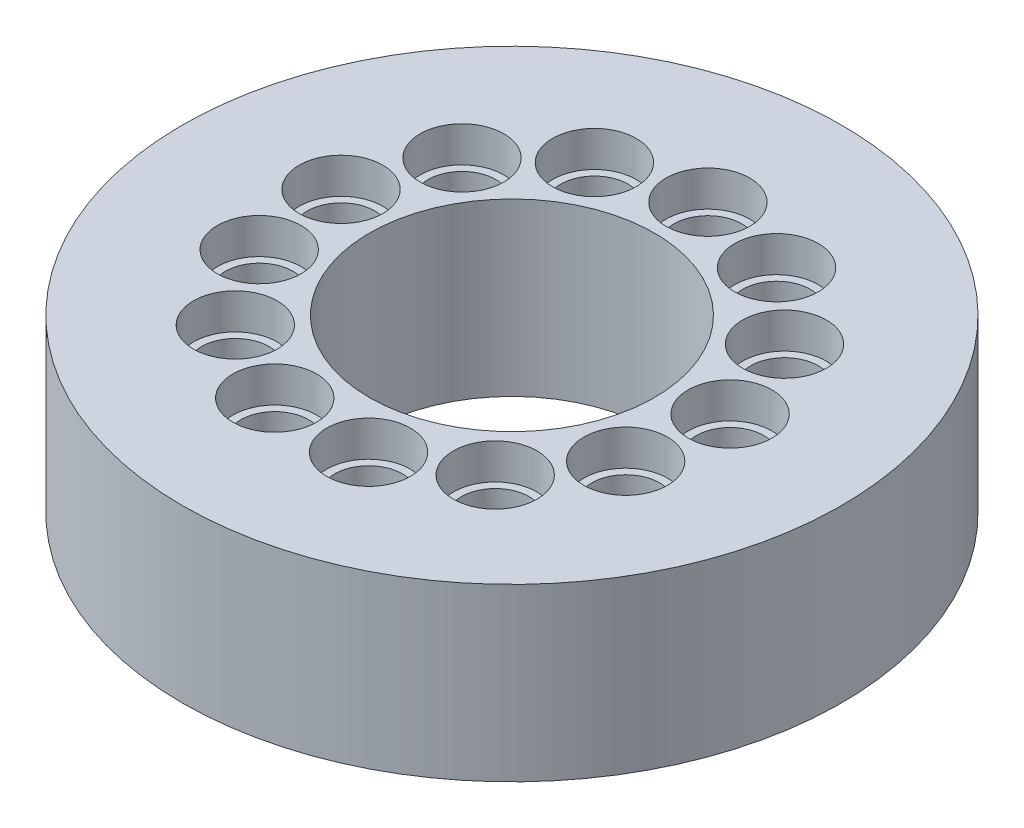
ISO-10303-21;
HEADER;
FILE_DESCRIPTION(('STEP AP214'),'2;1');
FILE_NAME('part.step','',(''),(''),'','','');
FILE_SCHEMA(('AUTOMOTIVE_DESIGN { 1 0 10303 214 1 1 1 1 }'));
ENDSEC;
DATA;
#1=APPLICATION_CONTEXT('core data for automotive mechanical design processes');
#2=APPLICATION_PROTOCOL_DEFINITION('international standard','automotive_design',2000,#1);
#3=PRODUCT_CONTEXT('',#1,'mechanical');
#4=PRODUCT('Part','Part','',(#3));
#5=PRODUCT_RELATED_PRODUCT_CATEGORY('part','',(#4));
#6=PRODUCT_DEFINITION_FORMATION('','',#4);
#7=PRODUCT_DEFINITION_CONTEXT('part definition',#1,'design');
#8=PRODUCT_DEFINITION('design','',#6,#7);
#9=PRODUCT_DEFINITION_SHAPE('','',#8);
#10=(LENGTH_UNIT() NAMED_UNIT(*) SI_UNIT(.MILLI.,.METRE.));
#11=(NAMED_UNIT(*) PLANE_ANGLE_UNIT() SI_UNIT($,.RADIAN.));
#12=(NAMED_UNIT(*) SI_UNIT($,.STERADIAN.) SOLID_ANGLE_UNIT());
#13=UNCERTAINTY_MEASURE_WITH_UNIT(LENGTH_MEASURE(1.E-05),#10,'distance_accuracy_value','');
#14=(GEOMETRIC_REPRESENTATION_CONTEXT(3) GLOBAL_UNCERTAINTY_ASSIGNED_CONTEXT((#13)) GLOBAL_UNIT_ASSIGNED_CONTEXT((#10,
#11,#12)) REPRESENTATION_CONTEXT('',''));
#15=CARTESIAN_POINT('',(0.,0.,0.));
#16=DIRECTION('',(0.,0.,1.));
#17=DIRECTION('',(1.,0.,0.));
#18=AXIS2_PLACEMENT_3D('',#15,#16,#17);
#19=CARTESIAN_POINT('',(0.,4.8,0.));
#20=DIRECTION('',(0.,1.,0.));
#21=DIRECTION('',(0.,0.,1.));
#22=AXIS2_PLACEMENT_3D('',#19,#20,#21);
#23=PLANE('',#22);
#24=CARTESIAN_POINT('',(-2.55597744624067,4.8,-4.87000814109269));
#25=DIRECTION('',(0.,1.,0.));
#26=DIRECTION('',(0.,0.,1.));
#27=AXIS2_PLACEMENT_3D('',#24,#25,#26);
#28=CIRCLE('',#27,1.17500000000001);
#29=CARTESIAN_POINT('',(-2.55597744624067,4.8,-3.69500814109267));
#30=VERTEX_POINT('',#29);
#31=EDGE_CURVE('E263',#30,#30,#28,.T.);
#32=ORIENTED_EDGE('',*,*,#31,.F.);
#33=EDGE_LOOP('',(#32));
#34=FACE_BOUND('',#33,.T.);
#35=CARTESIAN_POINT('',(-4.52641126241507,4.8,-3.12435610702141));
#36=DIRECTION('',(0.,1.,0.));
#37=DIRECTION('',(0.,0.,1.));
#38=AXIS2_PLACEMENT_3D('',#35,#36,#37);
#39=CIRCLE('',#38,1.17500000000001);
#40=CARTESIAN_POINT('',(-4.52641126241507,4.8,-1.9493561070214));
#41=VERTEX_POINT('',#40);
#42=EDGE_CURVE('E247',#41,#41,#39,.T.);
#43=ORIENTED_EDGE('',*,*,#42,.F.);
#44=EDGE_LOOP('',(#43));
#45=FACE_BOUND('',#44,.T.);
#46=CARTESIAN_POINT('',(-5.45989880753929,4.8,-0.662951741404336));
#47=DIRECTION('',(0.,1.,0.));
#48=DIRECTION('',(0.,0.,1.));
#49=AXIS2_PLACEMENT_3D('',#46,#47,#48);
#50=CIRCLE('',#49,1.17500000000001);
#51=CARTESIAN_POINT('',(-5.45989880753929,4.8,0.512048258595678));
#52=VERTEX_POINT('',#51);
#53=EDGE_CURVE('E231',#52,#52,#50,.T.);
#54=ORIENTED_EDGE('',*,*,#53,.F.);
#55=EDGE_LOOP('',(#54));
#56=FACE_BOUND('',#55,.T.);
#57=CARTESIAN_POINT('',(-5.1425893347698,4.8,1.9503268787339));
#58=DIRECTION('',(0.,1.,0.));
#59=DIRECTION('',(0.,0.,1.));
#60=AXIS2_PLACEMENT_3D('',#57,#58,#59);
#61=CIRCLE('',#60,1.17500000000001);
#62=CARTESIAN_POINT('',(-5.1425893347698,4.8,3.12532687873391));
#63=VERTEX_POINT('',#62);
#64=EDGE_CURVE('E215',#63,#63,#61,.T.);
#65=ORIENTED_EDGE('',*,*,#64,.F.);
#66=EDGE_LOOP('',(#65));
#67=FACE_BOUND('',#66,.T.);
#68=CARTESIAN_POINT('',(-3.64717462032441,4.8,4.11680911494102));
#69=DIRECTION('',(0.,1.,0.));
#70=DIRECTION('',(0.,0.,1.));
#71=AXIS2_PLACEMENT_3D('',#68,#69,#70);
#72=CIRCLE('',#71,1.17500000000001);
#73=CARTESIAN_POINT('',(-3.64717462032441,4.8,5.29180911494104));
#74=VERTEX_POINT('',#73);
#75=EDGE_CURVE('E199',#74,#74,#72,.T.);
#76=ORIENTED_EDGE('',*,*,#75,.F.);
#77=EDGE_LOOP('',(#76));
#78=FACE_BOUND('',#77,.T.);
#79=CARTESIAN_POINT('',(-1.31623615358161,4.8,5.34017999584328));
#80=DIRECTION('',(0.,1.,0.));
#81=DIRECTION('',(0.,0.,1.));
#82=AXIS2_PLACEMENT_3D('',#79,#80,#81);
#83=CIRCLE('',#82,1.17500000000001);
#84=CARTESIAN_POINT('',(-1.31623615358161,4.8,6.51517999584329));
#85=VERTEX_POINT('',#84);
#86=EDGE_CURVE('E183',#85,#85,#83,.T.);
#87=ORIENTED_EDGE('',*,*,#86,.F.);
#88=EDGE_LOOP('',(#87));
#89=FACE_BOUND('',#88,.T.);
#90=CARTESIAN_POINT('',(1.31623615358153,4.8,5.34017999584329));
#91=DIRECTION('',(0.,1.,0.));
#92=DIRECTION('',(0.,0.,1.));
#93=AXIS2_PLACEMENT_3D('',#90,#91,#92);
#94=CIRCLE('',#93,1.17500000000001);
#95=CARTESIAN_POINT('',(1.31623615358153,4.8,6.51517999584331));
#96=VERTEX_POINT('',#95);
#97=EDGE_CURVE('E167',#96,#96,#94,.T.);
#98=ORIENTED_EDGE('',*,*,#97,.F.);
#99=EDGE_LOOP('',(#98));
#100=FACE_BOUND('',#99,.T.);
#101=CARTESIAN_POINT('',(3.64717462032435,4.8,4.11680911494108));
#102=DIRECTION('',(0.,1.,0.));
#103=DIRECTION('',(0.,0.,1.));
#104=AXIS2_PLACEMENT_3D('',#101,#102,#103);
#105=CIRCLE('',#104,1.17500000000001);
#106=CARTESIAN_POINT('',(3.64717462032435,4.8,5.29180911494109));
#107=VERTEX_POINT('',#106);
#108=EDGE_CURVE('E151',#107,#107,#105,.T.);
#109=ORIENTED_EDGE('',*,*,#108,.F.);
#110=EDGE_LOOP('',(#109));
#111=FACE_BOUND('',#110,.T.);
#112=CARTESIAN_POINT('',(5.14258933476977,4.8,1.95032687873397));
#113=DIRECTION('',(0.,1.,0.));
#114=DIRECTION('',(0.,0.,1.));
#115=AXIS2_PLACEMENT_3D('',#112,#113,#114);
#116=CIRCLE('',#115,1.17500000000001);
#117=CARTESIAN_POINT('',(5.14258933476977,4.8,3.12532687873398));
#118=VERTEX_POINT('',#117);
#119=EDGE_CURVE('E135',#118,#118,#116,.T.);
#120=ORIENTED_EDGE('',*,*,#119,.F.);
#121=EDGE_LOOP('',(#120));
#122=FACE_BOUND('',#121,.T.);
#123=CARTESIAN_POINT('',(5.4598988075393,4.8,-0.662951741404259));
#124=DIRECTION('',(0.,1.,0.));
#125=DIRECTION('',(0.,0.,1.));
#126=AXIS2_PLACEMENT_3D('',#123,#124,#125);
#127=CIRCLE('',#126,1.17500000000001);
#128=CARTESIAN_POINT('',(5.4598988075393,4.8,0.512048258595754));
#129=VERTEX_POINT('',#128);
#130=EDGE_CURVE('E119',#129,#129,#127,.T.);
#131=ORIENTED_EDGE('',*,*,#130,.F.);
#132=EDGE_LOOP('',(#131));
#133=FACE_BOUND('',#132,.T.);
#134=CARTESIAN_POINT('',(4.52641126241512,4.8,-3.12435610702135));
#135=DIRECTION('',(0.,1.,0.));
#136=DIRECTION('',(0.,0.,1.));
#137=AXIS2_PLACEMENT_3D('',#134,#135,#136);
#138=CIRCLE('',#137,1.17500000000001);
#139=CARTESIAN_POINT('',(4.52641126241512,4.8,-1.94935610702133));
#140=VERTEX_POINT('',#139);
#141=EDGE_CURVE('E103',#140,#140,#138,.T.);
#142=ORIENTED_EDGE('',*,*,#141,.F.);
#143=EDGE_LOOP('',(#142));
#144=FACE_BOUND('',#143,.T.);
#145=CARTESIAN_POINT('',(2.55597744624073,4.8,-4.87000814109265));
#146=DIRECTION('',(0.,1.,0.));
#147=DIRECTION('',(0.,0.,1.));
#148=AXIS2_PLACEMENT_3D('',#145,#146,#147);
#149=CIRCLE('',#148,1.17500000000001);
#150=CARTESIAN_POINT('',(2.55597744624073,4.8,-3.69500814109264));
#151=VERTEX_POINT('',#150);
#152=EDGE_CURVE('E87',#151,#151,#149,.T.);
#153=ORIENTED_EDGE('',*,*,#152,.F.);
#154=EDGE_LOOP('',(#153));
#155=FACE_BOUND('',#154,.T.);
#156=CARTESIAN_POINT('',(0.,4.8,-5.5));
#157=DIRECTION('',(0.,1.,0.));
#158=DIRECTION('',(0.,0.,1.));
#159=AXIS2_PLACEMENT_3D('',#156,#157,#158);
#160=CIRCLE('',#159,1.17500000000001);
#161=CARTESIAN_POINT('',(0.,4.8,-4.32499999999999));
#162=VERTEX_POINT('',#161);
#163=EDGE_CURVE('E71',#162,#162,#160,.T.);
#164=ORIENTED_EDGE('',*,*,#163,.F.);
#165=EDGE_LOOP('',(#164));
#166=FACE_BOUND('',#165,.T.);
#167=CARTESIAN_POINT('',(0.,4.8,0.));
#168=DIRECTION('',(0.,1.,0.));
#169=DIRECTION('',(0.,0.,1.));
#170=AXIS2_PLACEMENT_3D('',#167,#168,#169);
#171=CIRCLE('',#170,9.25);
#172=CARTESIAN_POINT('',(0.,4.8,9.25));
#173=VERTEX_POINT('',#172);
#174=EDGE_CURVE('E10',#173,#173,#171,.T.);
#175=ORIENTED_EDGE('',*,*,#174,.T.);
#176=EDGE_LOOP('',(#175));
#177=FACE_BOUND('',#176,.T.);
#178=CARTESIAN_POINT('',(0.,4.8,0.));
#179=DIRECTION('',(0.,1.,0.));
#180=DIRECTION('',(0.,0.,1.));
#181=AXIS2_PLACEMENT_3D('',#178,#179,#180);
#182=CIRCLE('',#181,4.);
#183=CARTESIAN_POINT('',(0.,4.8,4.));
#184=VERTEX_POINT('',#183);
#185=EDGE_CURVE('E50',#184,#184,#182,.T.);
#186=ORIENTED_EDGE('',*,*,#185,.F.);
#187=EDGE_LOOP('',(#186));
#188=FACE_BOUND('',#187,.T.);
#189=ADVANCED_FACE('F37',(#34,#45,#56,#67,#78,#89,#100,#111,#122,#133,#144,#155,#166,#177,#188),
#23,.T.);
#190=CARTESIAN_POINT('',(0.,0.,0.));
#191=DIRECTION('',(0.,1.,0.));
#192=DIRECTION('',(0.,0.,1.));
#193=AXIS2_PLACEMENT_3D('',#190,#191,#192);
#194=PLANE('',#193);
#195=CARTESIAN_POINT('',(-2.55597744624067,0.,-4.87000814109269));
#196=DIRECTION('',(0.,1.,0.));
#197=DIRECTION('',(0.,0.,1.));
#198=AXIS2_PLACEMENT_3D('',#195,#196,#197);
#199=CIRCLE('',#198,0.950000000000013);
#200=CARTESIAN_POINT('',(-2.55597744624067,0.,-3.92000814109267));
#201=VERTEX_POINT('',#200);
#202=EDGE_CURVE('E251',#201,#201,#199,.T.);
#203=ORIENTED_EDGE('',*,*,#202,.T.);
#204=EDGE_LOOP('',(#203));
#205=FACE_BOUND('',#204,.T.);
#206=CARTESIAN_POINT('',(-4.52641126241507,0.,-3.12435610702141));
#207=DIRECTION('',(0.,1.,0.));
#208=DIRECTION('',(0.,0.,1.));
#209=AXIS2_PLACEMENT_3D('',#206,#207,#208);
#210=CIRCLE('',#209,0.950000000000013);
#211=CARTESIAN_POINT('',(-4.52641126241507,0.,-2.1743561070214));
#212=VERTEX_POINT('',#211);
#213=EDGE_CURVE('E235',#212,#212,#210,.T.);
#214=ORIENTED_EDGE('',*,*,#213,.T.);
#215=EDGE_LOOP('',(#214));
#216=FACE_BOUND('',#215,.T.);
#217=CARTESIAN_POINT('',(-5.45989880753929,0.,-0.662951741404336));
#218=DIRECTION('',(0.,1.,0.));
#219=DIRECTION('',(0.,0.,1.));
#220=AXIS2_PLACEMENT_3D('',#217,#218,#219);
#221=CIRCLE('',#220,0.950000000000013);
#222=CARTESIAN_POINT('',(-5.45989880753929,0.,0.287048258595677));
#223=VERTEX_POINT('',#222);
#224=EDGE_CURVE('E219',#223,#223,#221,.T.);
#225=ORIENTED_EDGE('',*,*,#224,.T.);
#226=EDGE_LOOP('',(#225));
#227=FACE_BOUND('',#226,.T.);
#228=CARTESIAN_POINT('',(-5.1425893347698,0.,1.9503268787339));
#229=DIRECTION('',(0.,1.,0.));
#230=DIRECTION('',(0.,0.,1.));
#231=AXIS2_PLACEMENT_3D('',#228,#229,#230);
#232=CIRCLE('',#231,0.950000000000013);
#233=CARTESIAN_POINT('',(-5.1425893347698,0.,2.90032687873391));
#234=VERTEX_POINT('',#233);
#235=EDGE_CURVE('E203',#234,#234,#232,.T.);
#236=ORIENTED_EDGE('',*,*,#235,.T.);
#237=EDGE_LOOP('',(#236));
#238=FACE_BOUND('',#237,.T.);
#239=CARTESIAN_POINT('',(-3.64717462032441,0.,4.11680911494102));
#240=DIRECTION('',(0.,1.,0.));
#241=DIRECTION('',(0.,0.,1.));
#242=AXIS2_PLACEMENT_3D('',#239,#240,#241);
#243=CIRCLE('',#242,0.950000000000013);
#244=CARTESIAN_POINT('',(-3.64717462032441,0.,5.06680911494104));
#245=VERTEX_POINT('',#244);
#246=EDGE_CURVE('E187',#245,#245,#243,.T.);
#247=ORIENTED_EDGE('',*,*,#246,.T.);
#248=EDGE_LOOP('',(#247));
#249=FACE_BOUND('',#248,.T.);
#250=CARTESIAN_POINT('',(-1.31623615358161,0.,5.34017999584328));
#251=DIRECTION('',(0.,1.,0.));
#252=DIRECTION('',(0.,0.,1.));
#253=AXIS2_PLACEMENT_3D('',#250,#251,#252);
#254=CIRCLE('',#253,0.950000000000013);
#255=CARTESIAN_POINT('',(-1.31623615358161,0.,6.29017999584329));
#256=VERTEX_POINT('',#255);
#257=EDGE_CURVE('E171',#256,#256,#254,.T.);
#258=ORIENTED_EDGE('',*,*,#257,.T.);
#259=EDGE_LOOP('',(#258));
#260=FACE_BOUND('',#259,.T.);
#261=CARTESIAN_POINT('',(1.31623615358153,0.,5.34017999584329));
#262=DIRECTION('',(0.,1.,0.));
#263=DIRECTION('',(0.,0.,1.));
#264=AXIS2_PLACEMENT_3D('',#261,#262,#263);
#265=CIRCLE('',#264,0.950000000000013);
#266=CARTESIAN_POINT('',(1.31623615358153,0.,6.29017999584331));
#267=VERTEX_POINT('',#266);
#268=EDGE_CURVE('E155',#267,#267,#265,.T.);
#269=ORIENTED_EDGE('',*,*,#268,.T.);
#270=EDGE_LOOP('',(#269));
#271=FACE_BOUND('',#270,.T.);
#272=CARTESIAN_POINT('',(3.64717462032435,0.,4.11680911494108));
#273=DIRECTION('',(0.,1.,0.));
#274=DIRECTION('',(0.,0.,1.));
#275=AXIS2_PLACEMENT_3D('',#272,#273,#274);
#276=CIRCLE('',#275,0.950000000000013);
#277=CARTESIAN_POINT('',(3.64717462032435,0.,5.06680911494109));
#278=VERTEX_POINT('',#277);
#279=EDGE_CURVE('E139',#278,#278,#276,.T.);
#280=ORIENTED_EDGE('',*,*,#279,.T.);
#281=EDGE_LOOP('',(#280));
#282=FACE_BOUND('',#281,.T.);
#283=CARTESIAN_POINT('',(5.14258933476977,0.,1.95032687873397));
#284=DIRECTION('',(0.,1.,0.));
#285=DIRECTION('',(0.,0.,1.));
#286=AXIS2_PLACEMENT_3D('',#283,#284,#285);
#287=CIRCLE('',#286,0.950000000000013);
#288=CARTESIAN_POINT('',(5.14258933476977,0.,2.90032687873398));
#289=VERTEX_POINT('',#288);
#290=EDGE_CURVE('E123',#289,#289,#287,.T.);
#291=ORIENTED_EDGE('',*,*,#290,.T.);
#292=EDGE_LOOP('',(#291));
#293=FACE_BOUND('',#292,.T.);
#294=CARTESIAN_POINT('',(5.4598988075393,0.,-0.662951741404259));
#295=DIRECTION('',(0.,1.,0.));
#296=DIRECTION('',(0.,0.,1.));
#297=AXIS2_PLACEMENT_3D('',#294,#295,#296);
#298=CIRCLE('',#297,0.950000000000013);
#299=CARTESIAN_POINT('',(5.4598988075393,0.,0.287048258595754));
#300=VERTEX_POINT('',#299);
#301=EDGE_CURVE('E107',#300,#300,#298,.T.);
#302=ORIENTED_EDGE('',*,*,#301,.T.);
#303=EDGE_LOOP('',(#302));
#304=FACE_BOUND('',#303,.T.);
#305=CARTESIAN_POINT('',(4.52641126241512,0.,-3.12435610702135));
#306=DIRECTION('',(0.,1.,0.));
#307=DIRECTION('',(0.,0.,1.));
#308=AXIS2_PLACEMENT_3D('',#305,#306,#307);
#309=CIRCLE('',#308,0.950000000000013);
#310=CARTESIAN_POINT('',(4.52641126241512,0.,-2.17435610702133));
#311=VERTEX_POINT('',#310);
#312=EDGE_CURVE('E91',#311,#311,#309,.T.);
#313=ORIENTED_EDGE('',*,*,#312,.T.);
#314=EDGE_LOOP('',(#313));
#315=FACE_BOUND('',#314,.T.);
#316=CARTESIAN_POINT('',(2.55597744624073,0.,-4.87000814109265));
#317=DIRECTION('',(0.,1.,0.));
#318=DIRECTION('',(0.,0.,1.));
#319=AXIS2_PLACEMENT_3D('',#316,#317,#318);
#320=CIRCLE('',#319,0.950000000000013);
#321=CARTESIAN_POINT('',(2.55597744624073,0.,-3.92000814109264));
#322=VERTEX_POINT('',#321);
#323=EDGE_CURVE('E75',#322,#322,#320,.T.);
#324=ORIENTED_EDGE('',*,*,#323,.T.);
#325=EDGE_LOOP('',(#324));
#326=FACE_BOUND('',#325,.T.);
#327=CARTESIAN_POINT('',(0.,0.,-5.5));
#328=DIRECTION('',(0.,1.,0.));
#329=DIRECTION('',(0.,0.,1.));
#330=AXIS2_PLACEMENT_3D('',#327,#328,#329);
#331=CIRCLE('',#330,0.950000000000013);
#332=CARTESIAN_POINT('',(0.,0.,-4.54999999999999));
#333=VERTEX_POINT('',#332);
#334=EDGE_CURVE('E56',#333,#333,#331,.T.);
#335=ORIENTED_EDGE('',*,*,#334,.T.);
#336=EDGE_LOOP('',(#335));
#337=FACE_BOUND('',#336,.T.);
#338=CARTESIAN_POINT('',(0.,0.,0.));
#339=DIRECTION('',(0.,1.,0.));
#340=DIRECTION('',(0.,0.,1.));
#341=AXIS2_PLACEMENT_3D('',#338,#339,#340);
#342=CIRCLE('',#341,9.25);
#343=CARTESIAN_POINT('',(0.,0.,9.25));
#344=VERTEX_POINT('',#343);
#345=EDGE_CURVE('E41',#344,#344,#342,.T.);
#346=ORIENTED_EDGE('',*,*,#345,.F.);
#347=EDGE_LOOP('',(#346));
#348=FACE_BOUND('',#347,.T.);
#349=CARTESIAN_POINT('',(0.,0.,0.));
#350=DIRECTION('',(0.,1.,0.));
#351=DIRECTION('',(0.,0.,1.));
#352=AXIS2_PLACEMENT_3D('',#349,#350,#351);
#353=CIRCLE('',#352,4.);
#354=CARTESIAN_POINT('',(0.,0.,4.));
#355=VERTEX_POINT('',#354);
#356=EDGE_CURVE('E52',#355,#355,#353,.T.);
#357=ORIENTED_EDGE('',*,*,#356,.T.);
#358=EDGE_LOOP('',(#357));
#359=FACE_BOUND('',#358,.T.);
#360=ADVANCED_FACE('F272',(#205,#216,#227,#238,#249,#260,#271,#282,#293,#304,#315,#326,#337,
#348,#359),#194,.F.);
#361=CARTESIAN_POINT('',(0.,4.8,0.));
#362=DIRECTION('',(0.,-1.,0.));
#363=DIRECTION('',(0.,0.,-1.));
#364=AXIS2_PLACEMENT_3D('',#361,#362,#363);
#365=CYLINDRICAL_SURFACE('',#364,9.25);
#366=ORIENTED_EDGE('',*,*,#174,.F.);
#367=EDGE_LOOP('',(#366));
#368=FACE_BOUND('',#367,.T.);
#369=ORIENTED_EDGE('',*,*,#345,.T.);
#370=EDGE_LOOP('',(#369));
#371=FACE_BOUND('',#370,.T.);
#372=ADVANCED_FACE('F39',(#368,#371),#365,.T.);
#373=CARTESIAN_POINT('',(0.,4.8,0.));
#374=DIRECTION('',(0.,-1.,0.));
#375=DIRECTION('',(0.,0.,-1.));
#376=AXIS2_PLACEMENT_3D('',#373,#374,#375);
#377=CYLINDRICAL_SURFACE('',#376,4.);
#378=ORIENTED_EDGE('',*,*,#185,.T.);
#379=EDGE_LOOP('',(#378));
#380=FACE_BOUND('',#379,.T.);
#381=ORIENTED_EDGE('',*,*,#356,.F.);
#382=EDGE_LOOP('',(#381));
#383=FACE_BOUND('',#382,.T.);
#384=ADVANCED_FACE('F300',(#380,#383),#377,.F.);
#385=CARTESIAN_POINT('',(0.,4.8,-5.5));
#386=DIRECTION('',(0.,1.,0.));
#387=DIRECTION('',(0.,0.,1.));
#388=AXIS2_PLACEMENT_3D('',#385,#386,#387);
#389=CYLINDRICAL_SURFACE('',#388,0.950000000000013);
#390=ORIENTED_EDGE('',*,*,#334,.F.);
#391=EDGE_LOOP('',(#390));
#392=FACE_BOUND('',#391,.T.);
#393=CARTESIAN_POINT('',(0.,3.8,-5.5));
#394=DIRECTION('',(0.,1.,0.));
#395=DIRECTION('',(0.,0.,1.));
#396=AXIS2_PLACEMENT_3D('',#393,#394,#395);
#397=CIRCLE('',#396,0.950000000000013);
#398=CARTESIAN_POINT('',(0.,3.8,-4.54999999999999));
#399=VERTEX_POINT('',#398);
#400=EDGE_CURVE('E63',#399,#399,#397,.T.);
#401=ORIENTED_EDGE('',*,*,#400,.T.);
#402=EDGE_LOOP('',(#401));
#403=FACE_BOUND('',#402,.T.);
#404=ADVANCED_FACE('F303',(#392,#403),#389,.F.);
#405=CARTESIAN_POINT('',(0.950000000000013,3.8,-5.5));
#406=DIRECTION('',(0.,-1.,0.));
#407=DIRECTION('',(0.,0.,-1.));
#408=AXIS2_PLACEMENT_3D('',#405,#406,#407);
#409=PLANE('',#408);
#410=ORIENTED_EDGE('',*,*,#400,.F.);
#411=EDGE_LOOP('',(#410));
#412=FACE_BOUND('',#411,.T.);
#413=CARTESIAN_POINT('',(0.,3.8,-5.5));
#414=DIRECTION('',(0.,1.,0.));
#415=DIRECTION('',(0.,0.,1.));
#416=AXIS2_PLACEMENT_3D('',#413,#414,#415);
#417=CIRCLE('',#416,1.17500000000001);
#418=CARTESIAN_POINT('',(0.,3.8,-4.32499999999999));
#419=VERTEX_POINT('',#418);
#420=EDGE_CURVE('E67',#419,#419,#417,.T.);
#421=ORIENTED_EDGE('',*,*,#420,.T.);
#422=EDGE_LOOP('',(#421));
#423=FACE_BOUND('',#422,.T.);
#424=ADVANCED_FACE('F317',(#412,#423),#409,.F.);
#425=CARTESIAN_POINT('',(0.,4.8,-5.5));
#426=DIRECTION('',(0.,1.,0.));
#427=DIRECTION('',(0.,0.,1.));
#428=AXIS2_PLACEMENT_3D('',#425,#426,#427);
#429=CYLINDRICAL_SURFACE('',#428,1.17500000000001);
#430=ORIENTED_EDGE('',*,*,#420,.F.);
#431=EDGE_LOOP('',(#430));
#432=FACE_BOUND('',#431,.T.);
#433=ORIENTED_EDGE('',*,*,#163,.T.);
#434=EDGE_LOOP('',(#433));
#435=FACE_BOUND('',#434,.T.);
#436=ADVANCED_FACE('F321',(#432,#435),#429,.F.);
#437=CARTESIAN_POINT('',(2.55597744624073,4.8,-4.87000814109265));
#438=DIRECTION('',(0.,1.,0.));
#439=DIRECTION('',(0.,0.,1.));
#440=AXIS2_PLACEMENT_3D('',#437,#438,#439);
#441=CYLINDRICAL_SURFACE('',#440,0.950000000000013);
#442=ORIENTED_EDGE('',*,*,#323,.F.);
#443=EDGE_LOOP('',(#442));
#444=FACE_BOUND('',#443,.T.);
#445=CARTESIAN_POINT('',(2.55597744624073,3.8,-4.87000814109265));
#446=DIRECTION('',(0.,1.,0.));
#447=DIRECTION('',(0.,0.,1.));
#448=AXIS2_PLACEMENT_3D('',#445,#446,#447);
#449=CIRCLE('',#448,0.950000000000013);
#450=CARTESIAN_POINT('',(2.55597744624073,3.8,-3.92000814109264));
#451=VERTEX_POINT('',#450);
#452=EDGE_CURVE('E79',#451,#451,#449,.T.);
#453=ORIENTED_EDGE('',*,*,#452,.T.);
#454=EDGE_LOOP('',(#453));
#455=FACE_BOUND('',#454,.T.);
#456=ADVANCED_FACE('F325',(#444,#455),#441,.F.);
#457=CARTESIAN_POINT('',(3.50597744624075,3.8,-4.87000814109265));
#458=DIRECTION('',(0.,-1.,0.));
#459=DIRECTION('',(0.,0.,-1.));
#460=AXIS2_PLACEMENT_3D('',#457,#458,#459);
#461=PLANE('',#460);
#462=ORIENTED_EDGE('',*,*,#452,.F.);
#463=EDGE_LOOP('',(#462));
#464=FACE_BOUND('',#463,.T.);
#465=CARTESIAN_POINT('',(2.55597744624073,3.8,-4.87000814109265));
#466=DIRECTION('',(0.,1.,0.));
#467=DIRECTION('',(0.,0.,1.));
#468=AXIS2_PLACEMENT_3D('',#465,#466,#467);
#469=CIRCLE('',#468,1.17500000000001);
#470=CARTESIAN_POINT('',(2.55597744624073,3.8,-3.69500814109264));
#471=VERTEX_POINT('',#470);
#472=EDGE_CURVE('E83',#471,#471,#469,.T.);
#473=ORIENTED_EDGE('',*,*,#472,.T.);
#474=EDGE_LOOP('',(#473));
#475=FACE_BOUND('',#474,.T.);
#476=ADVANCED_FACE('F329',(#464,#475),#461,.F.);
#477=CARTESIAN_POINT('',(2.55597744624073,4.8,-4.87000814109265));
#478=DIRECTION('',(0.,1.,0.));
#479=DIRECTION('',(0.,0.,1.));
#480=AXIS2_PLACEMENT_3D('',#477,#478,#479);
#481=CYLINDRICAL_SURFACE('',#480,1.17500000000001);
#482=ORIENTED_EDGE('',*,*,#472,.F.);
#483=EDGE_LOOP('',(#482));
#484=FACE_BOUND('',#483,.T.);
#485=ORIENTED_EDGE('',*,*,#152,.T.);
#486=EDGE_LOOP('',(#485));
#487=FACE_BOUND('',#486,.T.);
#488=ADVANCED_FACE('F333',(#484,#487),#481,.F.);
#489=CARTESIAN_POINT('',(4.52641126241512,4.8,-3.12435610702135));
#490=DIRECTION('',(0.,1.,0.));
#491=DIRECTION('',(0.,0.,1.));
#492=AXIS2_PLACEMENT_3D('',#489,#490,#491);
#493=CYLINDRICAL_SURFACE('',#492,0.950000000000013);
#494=ORIENTED_EDGE('',*,*,#312,.F.);
#495=EDGE_LOOP('',(#494));
#496=FACE_BOUND('',#495,.T.);
#497=CARTESIAN_POINT('',(4.52641126241512,3.8,-3.12435610702135));
#498=DIRECTION('',(0.,1.,0.));
#499=DIRECTION('',(0.,0.,1.));
#500=AXIS2_PLACEMENT_3D('',#497,#498,#499);
#501=CIRCLE('',#500,0.950000000000013);
#502=CARTESIAN_POINT('',(4.52641126241512,3.8,-2.17435610702133));
#503=VERTEX_POINT('',#502);
#504=EDGE_CURVE('E95',#503,#503,#501,.T.);
#505=ORIENTED_EDGE('',*,*,#504,.T.);
#506=EDGE_LOOP('',(#505));
#507=FACE_BOUND('',#506,.T.);
#508=ADVANCED_FACE('F337',(#496,#507),#493,.F.);
#509=CARTESIAN_POINT('',(5.47641126241513,3.8,-3.12435610702135));
#510=DIRECTION('',(0.,-1.,0.));
#511=DIRECTION('',(0.,0.,-1.));
#512=AXIS2_PLACEMENT_3D('',#509,#510,#511);
#513=PLANE('',#512);
#514=ORIENTED_EDGE('',*,*,#504,.F.);
#515=EDGE_LOOP('',(#514));
#516=FACE_BOUND('',#515,.T.);
#517=CARTESIAN_POINT('',(4.52641126241512,3.8,-3.12435610702135));
#518=DIRECTION('',(0.,1.,0.));
#519=DIRECTION('',(0.,0.,1.));
#520=AXIS2_PLACEMENT_3D('',#517,#518,#519);
#521=CIRCLE('',#520,1.17500000000001);
#522=CARTESIAN_POINT('',(4.52641126241512,3.8,-1.94935610702133));
#523=VERTEX_POINT('',#522);
#524=EDGE_CURVE('E99',#523,#523,#521,.T.);
#525=ORIENTED_EDGE('',*,*,#524,.T.);
#526=EDGE_LOOP('',(#525));
#527=FACE_BOUND('',#526,.T.);
#528=ADVANCED_FACE('F341',(#516,#527),#513,.F.);
#529=CARTESIAN_POINT('',(4.52641126241512,4.8,-3.12435610702135));
#530=DIRECTION('',(0.,1.,0.));
#531=DIRECTION('',(0.,0.,1.));
#532=AXIS2_PLACEMENT_3D('',#529,#530,#531);
#533=CYLINDRICAL_SURFACE('',#532,1.17500000000001);
#534=ORIENTED_EDGE('',*,*,#524,.F.);
#535=EDGE_LOOP('',(#534));
#536=FACE_BOUND('',#535,.T.);
#537=ORIENTED_EDGE('',*,*,#141,.T.);
#538=EDGE_LOOP('',(#537));
#539=FACE_BOUND('',#538,.T.);
#540=ADVANCED_FACE('F345',(#536,#539),#533,.F.);
#541=CARTESIAN_POINT('',(5.4598988075393,4.8,-0.662951741404259));
#542=DIRECTION('',(0.,1.,0.));
#543=DIRECTION('',(0.,0.,1.));
#544=AXIS2_PLACEMENT_3D('',#541,#542,#543);
#545=CYLINDRICAL_SURFACE('',#544,0.950000000000013);
#546=ORIENTED_EDGE('',*,*,#301,.F.);
#547=EDGE_LOOP('',(#546));
#548=FACE_BOUND('',#547,.T.);
#549=CARTESIAN_POINT('',(5.4598988075393,3.8,-0.662951741404259));
#550=DIRECTION('',(0.,1.,0.));
#551=DIRECTION('',(0.,0.,1.));
#552=AXIS2_PLACEMENT_3D('',#549,#550,#551);
#553=CIRCLE('',#552,0.950000000000013);
#554=CARTESIAN_POINT('',(5.4598988075393,3.8,0.287048258595754));
#555=VERTEX_POINT('',#554);
#556=EDGE_CURVE('E111',#555,#555,#553,.T.);
#557=ORIENTED_EDGE('',*,*,#556,.T.);
#558=EDGE_LOOP('',(#557));
#559=FACE_BOUND('',#558,.T.);
#560=ADVANCED_FACE('F349',(#548,#559),#545,.F.);
#561=CARTESIAN_POINT('',(6.40989880753931,3.8,-0.662951741404259));
#562=DIRECTION('',(0.,-1.,0.));
#563=DIRECTION('',(0.,0.,-1.));
#564=AXIS2_PLACEMENT_3D('',#561,#562,#563);
#565=PLANE('',#564);
#566=ORIENTED_EDGE('',*,*,#556,.F.);
#567=EDGE_LOOP('',(#566));
#568=FACE_BOUND('',#567,.T.);
#569=CARTESIAN_POINT('',(5.4598988075393,3.8,-0.662951741404259));
#570=DIRECTION('',(0.,1.,0.));
#571=DIRECTION('',(0.,0.,1.));
#572=AXIS2_PLACEMENT_3D('',#569,#570,#571);
#573=CIRCLE('',#572,1.17500000000001);
#574=CARTESIAN_POINT('',(5.4598988075393,3.8,0.512048258595753));
#575=VERTEX_POINT('',#574);
#576=EDGE_CURVE('E115',#575,#575,#573,.T.);
#577=ORIENTED_EDGE('',*,*,#576,.T.);
#578=EDGE_LOOP('',(#577));
#579=FACE_BOUND('',#578,.T.);
#580=ADVANCED_FACE('F353',(#568,#579),#565,.F.);
#581=CARTESIAN_POINT('',(5.4598988075393,4.8,-0.662951741404259));
#582=DIRECTION('',(0.,1.,0.));
#583=DIRECTION('',(0.,0.,1.));
#584=AXIS2_PLACEMENT_3D('',#581,#582,#583);
#585=CYLINDRICAL_SURFACE('',#584,1.17500000000001);
#586=ORIENTED_EDGE('',*,*,#576,.F.);
#587=EDGE_LOOP('',(#586));
#588=FACE_BOUND('',#587,.T.);
#589=ORIENTED_EDGE('',*,*,#130,.T.);
#590=EDGE_LOOP('',(#589));
#591=FACE_BOUND('',#590,.T.);
#592=ADVANCED_FACE('F357',(#588,#591),#585,.F.);
#593=CARTESIAN_POINT('',(5.14258933476977,4.8,1.95032687873397));
#594=DIRECTION('',(0.,1.,0.));
#595=DIRECTION('',(0.,0.,1.));
#596=AXIS2_PLACEMENT_3D('',#593,#594,#595);
#597=CYLINDRICAL_SURFACE('',#596,0.950000000000013);
#598=ORIENTED_EDGE('',*,*,#290,.F.);
#599=EDGE_LOOP('',(#598));
#600=FACE_BOUND('',#599,.T.);
#601=CARTESIAN_POINT('',(5.14258933476977,3.8,1.95032687873397));
#602=DIRECTION('',(0.,1.,0.));
#603=DIRECTION('',(0.,0.,1.));
#604=AXIS2_PLACEMENT_3D('',#601,#602,#603);
#605=CIRCLE('',#604,0.950000000000013);
#606=CARTESIAN_POINT('',(5.14258933476977,3.8,2.90032687873398));
#607=VERTEX_POINT('',#606);
#608=EDGE_CURVE('E127',#607,#607,#605,.T.);
#609=ORIENTED_EDGE('',*,*,#608,.T.);
#610=EDGE_LOOP('',(#609));
#611=FACE_BOUND('',#610,.T.);
#612=ADVANCED_FACE('F361',(#600,#611),#597,.F.);
#613=CARTESIAN_POINT('',(6.09258933476979,3.8,1.95032687873397));
#614=DIRECTION('',(0.,-1.,0.));
#615=DIRECTION('',(0.,0.,-1.));
#616=AXIS2_PLACEMENT_3D('',#613,#614,#615);
#617=PLANE('',#616);
#618=ORIENTED_EDGE('',*,*,#608,.F.);
#619=EDGE_LOOP('',(#618));
#620=FACE_BOUND('',#619,.T.);
#621=CARTESIAN_POINT('',(5.14258933476977,3.8,1.95032687873397));
#622=DIRECTION('',(0.,1.,0.));
#623=DIRECTION('',(0.,0.,1.));
#624=AXIS2_PLACEMENT_3D('',#621,#622,#623);
#625=CIRCLE('',#624,1.17500000000001);
#626=CARTESIAN_POINT('',(5.14258933476977,3.8,3.12532687873398));
#627=VERTEX_POINT('',#626);
#628=EDGE_CURVE('E131',#627,#627,#625,.T.);
#629=ORIENTED_EDGE('',*,*,#628,.T.);
#630=EDGE_LOOP('',(#629));
#631=FACE_BOUND('',#630,.T.);
#632=ADVANCED_FACE('F365',(#620,#631),#617,.F.);
#633=CARTESIAN_POINT('',(5.14258933476977,4.8,1.95032687873397));
#634=DIRECTION('',(0.,1.,0.));
#635=DIRECTION('',(0.,0.,1.));
#636=AXIS2_PLACEMENT_3D('',#633,#634,#635);
#637=CYLINDRICAL_SURFACE('',#636,1.17500000000001);
#638=ORIENTED_EDGE('',*,*,#628,.F.);
#639=EDGE_LOOP('',(#638));
#640=FACE_BOUND('',#639,.T.);
#641=ORIENTED_EDGE('',*,*,#119,.T.);
#642=EDGE_LOOP('',(#641));
#643=FACE_BOUND('',#642,.T.);
#644=ADVANCED_FACE('F369',(#640,#643),#637,.F.);
#645=CARTESIAN_POINT('',(3.64717462032435,4.8,4.11680911494108));
#646=DIRECTION('',(0.,1.,0.));
#647=DIRECTION('',(0.,0.,1.));
#648=AXIS2_PLACEMENT_3D('',#645,#646,#647);
#649=CYLINDRICAL_SURFACE('',#648,0.950000000000013);
#650=ORIENTED_EDGE('',*,*,#279,.F.);
#651=EDGE_LOOP('',(#650));
#652=FACE_BOUND('',#651,.T.);
#653=CARTESIAN_POINT('',(3.64717462032435,3.8,4.11680911494108));
#654=DIRECTION('',(0.,1.,0.));
#655=DIRECTION('',(0.,0.,1.));
#656=AXIS2_PLACEMENT_3D('',#653,#654,#655);
#657=CIRCLE('',#656,0.950000000000013);
#658=CARTESIAN_POINT('',(3.64717462032435,3.8,5.06680911494109));
#659=VERTEX_POINT('',#658);
#660=EDGE_CURVE('E143',#659,#659,#657,.T.);
#661=ORIENTED_EDGE('',*,*,#660,.T.);
#662=EDGE_LOOP('',(#661));
#663=FACE_BOUND('',#662,.T.);
#664=ADVANCED_FACE('F373',(#652,#663),#649,.F.);
#665=CARTESIAN_POINT('',(4.59717462032437,3.8,4.11680911494108));
#666=DIRECTION('',(0.,-1.,0.));
#667=DIRECTION('',(0.,0.,-1.));
#668=AXIS2_PLACEMENT_3D('',#665,#666,#667);
#669=PLANE('',#668);
#670=ORIENTED_EDGE('',*,*,#660,.F.);
#671=EDGE_LOOP('',(#670));
#672=FACE_BOUND('',#671,.T.);
#673=CARTESIAN_POINT('',(3.64717462032435,3.8,4.11680911494108));
#674=DIRECTION('',(0.,1.,0.));
#675=DIRECTION('',(0.,0.,1.));
#676=AXIS2_PLACEMENT_3D('',#673,#674,#675);
#677=CIRCLE('',#676,1.17500000000001);
#678=CARTESIAN_POINT('',(3.64717462032435,3.8,5.29180911494109));
#679=VERTEX_POINT('',#678);
#680=EDGE_CURVE('E147',#679,#679,#677,.T.);
#681=ORIENTED_EDGE('',*,*,#680,.T.);
#682=EDGE_LOOP('',(#681));
#683=FACE_BOUND('',#682,.T.);
#684=ADVANCED_FACE('F377',(#672,#683),#669,.F.);
#685=CARTESIAN_POINT('',(3.64717462032435,4.8,4.11680911494108));
#686=DIRECTION('',(0.,1.,0.));
#687=DIRECTION('',(0.,0.,1.));
#688=AXIS2_PLACEMENT_3D('',#685,#686,#687);
#689=CYLINDRICAL_SURFACE('',#688,1.17500000000001);
#690=ORIENTED_EDGE('',*,*,#680,.F.);
#691=EDGE_LOOP('',(#690));
#692=FACE_BOUND('',#691,.T.);
#693=ORIENTED_EDGE('',*,*,#108,.T.);
#694=EDGE_LOOP('',(#693));
#695=FACE_BOUND('',#694,.T.);
#696=ADVANCED_FACE('F381',(#692,#695),#689,.F.);
#697=CARTESIAN_POINT('',(1.31623615358153,4.8,5.34017999584329));
#698=DIRECTION('',(0.,1.,0.));
#699=DIRECTION('',(0.,0.,1.));
#700=AXIS2_PLACEMENT_3D('',#697,#698,#699);
#701=CYLINDRICAL_SURFACE('',#700,0.950000000000013);
#702=ORIENTED_EDGE('',*,*,#268,.F.);
#703=EDGE_LOOP('',(#702));
#704=FACE_BOUND('',#703,.T.);
#705=CARTESIAN_POINT('',(1.31623615358153,3.8,5.34017999584329));
#706=DIRECTION('',(0.,1.,0.));
#707=DIRECTION('',(0.,0.,1.));
#708=AXIS2_PLACEMENT_3D('',#705,#706,#707);
#709=CIRCLE('',#708,0.950000000000013);
#710=CARTESIAN_POINT('',(1.31623615358153,3.8,6.29017999584331));
#711=VERTEX_POINT('',#710);
#712=EDGE_CURVE('E159',#711,#711,#709,.T.);
#713=ORIENTED_EDGE('',*,*,#712,.T.);
#714=EDGE_LOOP('',(#713));
#715=FACE_BOUND('',#714,.T.);
#716=ADVANCED_FACE('F385',(#704,#715),#701,.F.);
#717=CARTESIAN_POINT('',(2.26623615358155,3.8,5.34017999584329));
#718=DIRECTION('',(0.,-1.,0.));
#719=DIRECTION('',(0.,0.,-1.));
#720=AXIS2_PLACEMENT_3D('',#717,#718,#719);
#721=PLANE('',#720);
#722=ORIENTED_EDGE('',*,*,#712,.F.);
#723=EDGE_LOOP('',(#722));
#724=FACE_BOUND('',#723,.T.);
#725=CARTESIAN_POINT('',(1.31623615358153,3.8,5.34017999584329));
#726=DIRECTION('',(0.,1.,0.));
#727=DIRECTION('',(0.,0.,1.));
#728=AXIS2_PLACEMENT_3D('',#725,#726,#727);
#729=CIRCLE('',#728,1.17500000000001);
#730=CARTESIAN_POINT('',(1.31623615358153,3.8,6.51517999584331));
#731=VERTEX_POINT('',#730);
#732=EDGE_CURVE('E163',#731,#731,#729,.T.);
#733=ORIENTED_EDGE('',*,*,#732,.T.);
#734=EDGE_LOOP('',(#733));
#735=FACE_BOUND('',#734,.T.);
#736=ADVANCED_FACE('F389',(#724,#735),#721,.F.);
#737=CARTESIAN_POINT('',(1.31623615358153,4.8,5.34017999584329));
#738=DIRECTION('',(0.,1.,0.));
#739=DIRECTION('',(0.,0.,1.));
#740=AXIS2_PLACEMENT_3D('',#737,#738,#739);
#741=CYLINDRICAL_SURFACE('',#740,1.17500000000001);
#742=ORIENTED_EDGE('',*,*,#732,.F.);
#743=EDGE_LOOP('',(#742));
#744=FACE_BOUND('',#743,.T.);
#745=ORIENTED_EDGE('',*,*,#97,.T.);
#746=EDGE_LOOP('',(#745));
#747=FACE_BOUND('',#746,.T.);
#748=ADVANCED_FACE('F393',(#744,#747),#741,.F.);
#749=CARTESIAN_POINT('',(-1.31623615358161,4.8,5.34017999584328));
#750=DIRECTION('',(0.,1.,0.));
#751=DIRECTION('',(0.,0.,1.));
#752=AXIS2_PLACEMENT_3D('',#749,#750,#751);
#753=CYLINDRICAL_SURFACE('',#752,0.950000000000013);
#754=ORIENTED_EDGE('',*,*,#257,.F.);
#755=EDGE_LOOP('',(#754));
#756=FACE_BOUND('',#755,.T.);
#757=CARTESIAN_POINT('',(-1.31623615358161,3.8,5.34017999584328));
#758=DIRECTION('',(0.,1.,0.));
#759=DIRECTION('',(0.,0.,1.));
#760=AXIS2_PLACEMENT_3D('',#757,#758,#759);
#761=CIRCLE('',#760,0.950000000000013);
#762=CARTESIAN_POINT('',(-1.31623615358161,3.8,6.29017999584329));
#763=VERTEX_POINT('',#762);
#764=EDGE_CURVE('E175',#763,#763,#761,.T.);
#765=ORIENTED_EDGE('',*,*,#764,.T.);
#766=EDGE_LOOP('',(#765));
#767=FACE_BOUND('',#766,.T.);
#768=ADVANCED_FACE('F397',(#756,#767),#753,.F.);
#769=CARTESIAN_POINT('',(-0.366236153581595,3.8,5.34017999584328));
#770=DIRECTION('',(0.,-1.,0.));
#771=DIRECTION('',(0.,0.,-1.));
#772=AXIS2_PLACEMENT_3D('',#769,#770,#771);
#773=PLANE('',#772);
#774=ORIENTED_EDGE('',*,*,#764,.F.);
#775=EDGE_LOOP('',(#774));
#776=FACE_BOUND('',#775,.T.);
#777=CARTESIAN_POINT('',(-1.31623615358161,3.8,5.34017999584328));
#778=DIRECTION('',(0.,1.,0.));
#779=DIRECTION('',(0.,0.,1.));
#780=AXIS2_PLACEMENT_3D('',#777,#778,#779);
#781=CIRCLE('',#780,1.17500000000001);
#782=CARTESIAN_POINT('',(-1.31623615358161,3.8,6.51517999584329));
#783=VERTEX_POINT('',#782);
#784=EDGE_CURVE('E179',#783,#783,#781,.T.);
#785=ORIENTED_EDGE('',*,*,#784,.T.);
#786=EDGE_LOOP('',(#785));
#787=FACE_BOUND('',#786,.T.);
#788=ADVANCED_FACE('F401',(#776,#787),#773,.F.);
#789=CARTESIAN_POINT('',(-1.31623615358161,4.8,5.34017999584328));
#790=DIRECTION('',(0.,1.,0.));
#791=DIRECTION('',(0.,0.,1.));
#792=AXIS2_PLACEMENT_3D('',#789,#790,#791);
#793=CYLINDRICAL_SURFACE('',#792,1.17500000000001);
#794=ORIENTED_EDGE('',*,*,#784,.F.);
#795=EDGE_LOOP('',(#794));
#796=FACE_BOUND('',#795,.T.);
#797=ORIENTED_EDGE('',*,*,#86,.T.);
#798=EDGE_LOOP('',(#797));
#799=FACE_BOUND('',#798,.T.);
#800=ADVANCED_FACE('F405',(#796,#799),#793,.F.);
#801=CARTESIAN_POINT('',(-3.64717462032441,4.8,4.11680911494102));
#802=DIRECTION('',(0.,1.,0.));
#803=DIRECTION('',(0.,0.,1.));
#804=AXIS2_PLACEMENT_3D('',#801,#802,#803);
#805=CYLINDRICAL_SURFACE('',#804,0.950000000000013);
#806=ORIENTED_EDGE('',*,*,#246,.F.);
#807=EDGE_LOOP('',(#806));
#808=FACE_BOUND('',#807,.T.);
#809=CARTESIAN_POINT('',(-3.64717462032441,3.8,4.11680911494102));
#810=DIRECTION('',(0.,1.,0.));
#811=DIRECTION('',(0.,0.,1.));
#812=AXIS2_PLACEMENT_3D('',#809,#810,#811);
#813=CIRCLE('',#812,0.950000000000013);
#814=CARTESIAN_POINT('',(-3.64717462032441,3.8,5.06680911494104));
#815=VERTEX_POINT('',#814);
#816=EDGE_CURVE('E191',#815,#815,#813,.T.);
#817=ORIENTED_EDGE('',*,*,#816,.T.);
#818=EDGE_LOOP('',(#817));
#819=FACE_BOUND('',#818,.T.);
#820=ADVANCED_FACE('F409',(#808,#819),#805,.F.);
#821=CARTESIAN_POINT('',(-2.6971746203244,3.8,4.11680911494102));
#822=DIRECTION('',(0.,-1.,0.));
#823=DIRECTION('',(0.,0.,-1.));
#824=AXIS2_PLACEMENT_3D('',#821,#822,#823);
#825=PLANE('',#824);
#826=ORIENTED_EDGE('',*,*,#816,.F.);
#827=EDGE_LOOP('',(#826));
#828=FACE_BOUND('',#827,.T.);
#829=CARTESIAN_POINT('',(-3.64717462032441,3.8,4.11680911494102));
#830=DIRECTION('',(0.,1.,0.));
#831=DIRECTION('',(0.,0.,1.));
#832=AXIS2_PLACEMENT_3D('',#829,#830,#831);
#833=CIRCLE('',#832,1.17500000000001);
#834=CARTESIAN_POINT('',(-3.64717462032441,3.8,5.29180911494104));
#835=VERTEX_POINT('',#834);
#836=EDGE_CURVE('E195',#835,#835,#833,.T.);
#837=ORIENTED_EDGE('',*,*,#836,.T.);
#838=EDGE_LOOP('',(#837));
#839=FACE_BOUND('',#838,.T.);
#840=ADVANCED_FACE('F413',(#828,#839),#825,.F.);
#841=CARTESIAN_POINT('',(-3.64717462032441,4.8,4.11680911494102));
#842=DIRECTION('',(0.,1.,0.));
#843=DIRECTION('',(0.,0.,1.));
#844=AXIS2_PLACEMENT_3D('',#841,#842,#843);
#845=CYLINDRICAL_SURFACE('',#844,1.17500000000001);
#846=ORIENTED_EDGE('',*,*,#836,.F.);
#847=EDGE_LOOP('',(#846));
#848=FACE_BOUND('',#847,.T.);
#849=ORIENTED_EDGE('',*,*,#75,.T.);
#850=EDGE_LOOP('',(#849));
#851=FACE_BOUND('',#850,.T.);
#852=ADVANCED_FACE('F417',(#848,#851),#845,.F.);
#853=CARTESIAN_POINT('',(-5.1425893347698,4.8,1.9503268787339));
#854=DIRECTION('',(0.,1.,0.));
#855=DIRECTION('',(0.,0.,1.));
#856=AXIS2_PLACEMENT_3D('',#853,#854,#855);
#857=CYLINDRICAL_SURFACE('',#856,0.950000000000013);
#858=ORIENTED_EDGE('',*,*,#235,.F.);
#859=EDGE_LOOP('',(#858));
#860=FACE_BOUND('',#859,.T.);
#861=CARTESIAN_POINT('',(-5.1425893347698,3.8,1.9503268787339));
#862=DIRECTION('',(0.,1.,0.));
#863=DIRECTION('',(0.,0.,1.));
#864=AXIS2_PLACEMENT_3D('',#861,#862,#863);
#865=CIRCLE('',#864,0.950000000000013);
#866=CARTESIAN_POINT('',(-5.1425893347698,3.8,2.90032687873391));
#867=VERTEX_POINT('',#866);
#868=EDGE_CURVE('E207',#867,#867,#865,.T.);
#869=ORIENTED_EDGE('',*,*,#868,.T.);
#870=EDGE_LOOP('',(#869));
#871=FACE_BOUND('',#870,.T.);
#872=ADVANCED_FACE('F421',(#860,#871),#857,.F.);
#873=CARTESIAN_POINT('',(-4.19258933476979,3.8,1.9503268787339));
#874=DIRECTION('',(0.,-1.,0.));
#875=DIRECTION('',(0.,0.,-1.));
#876=AXIS2_PLACEMENT_3D('',#873,#874,#875);
#877=PLANE('',#876);
#878=ORIENTED_EDGE('',*,*,#868,.F.);
#879=EDGE_LOOP('',(#878));
#880=FACE_BOUND('',#879,.T.);
#881=CARTESIAN_POINT('',(-5.1425893347698,3.8,1.9503268787339));
#882=DIRECTION('',(0.,1.,0.));
#883=DIRECTION('',(0.,0.,1.));
#884=AXIS2_PLACEMENT_3D('',#881,#882,#883);
#885=CIRCLE('',#884,1.17500000000001);
#886=CARTESIAN_POINT('',(-5.1425893347698,3.8,3.12532687873391));
#887=VERTEX_POINT('',#886);
#888=EDGE_CURVE('E211',#887,#887,#885,.T.);
#889=ORIENTED_EDGE('',*,*,#888,.T.);
#890=EDGE_LOOP('',(#889));
#891=FACE_BOUND('',#890,.T.);
#892=ADVANCED_FACE('F425',(#880,#891),#877,.F.);
#893=CARTESIAN_POINT('',(-5.1425893347698,4.8,1.9503268787339));
#894=DIRECTION('',(0.,1.,0.));
#895=DIRECTION('',(0.,0.,1.));
#896=AXIS2_PLACEMENT_3D('',#893,#894,#895);
#897=CYLINDRICAL_SURFACE('',#896,1.17500000000001);
#898=ORIENTED_EDGE('',*,*,#888,.F.);
#899=EDGE_LOOP('',(#898));
#900=FACE_BOUND('',#899,.T.);
#901=ORIENTED_EDGE('',*,*,#64,.T.);
#902=EDGE_LOOP('',(#901));
#903=FACE_BOUND('',#902,.T.);
#904=ADVANCED_FACE('F429',(#900,#903),#897,.F.);
#905=CARTESIAN_POINT('',(-5.45989880753929,4.8,-0.662951741404336));
#906=DIRECTION('',(0.,1.,0.));
#907=DIRECTION('',(0.,0.,1.));
#908=AXIS2_PLACEMENT_3D('',#905,#906,#907);
#909=CYLINDRICAL_SURFACE('',#908,0.950000000000013);
#910=ORIENTED_EDGE('',*,*,#224,.F.);
#911=EDGE_LOOP('',(#910));
#912=FACE_BOUND('',#911,.T.);
#913=CARTESIAN_POINT('',(-5.45989880753929,3.8,-0.662951741404336));
#914=DIRECTION('',(0.,1.,0.));
#915=DIRECTION('',(0.,0.,1.));
#916=AXIS2_PLACEMENT_3D('',#913,#914,#915);
#917=CIRCLE('',#916,0.950000000000013);
#918=CARTESIAN_POINT('',(-5.45989880753929,3.8,0.287048258595677));
#919=VERTEX_POINT('',#918);
#920=EDGE_CURVE('E223',#919,#919,#917,.T.);
#921=ORIENTED_EDGE('',*,*,#920,.T.);
#922=EDGE_LOOP('',(#921));
#923=FACE_BOUND('',#922,.T.);
#924=ADVANCED_FACE('F433',(#912,#923),#909,.F.);
#925=CARTESIAN_POINT('',(-4.50989880753928,3.8,-0.662951741404336));
#926=DIRECTION('',(0.,-1.,0.));
#927=DIRECTION('',(0.,0.,-1.));
#928=AXIS2_PLACEMENT_3D('',#925,#926,#927);
#929=PLANE('',#928);
#930=ORIENTED_EDGE('',*,*,#920,.F.);
#931=EDGE_LOOP('',(#930));
#932=FACE_BOUND('',#931,.T.);
#933=CARTESIAN_POINT('',(-5.45989880753929,3.8,-0.662951741404336));
#934=DIRECTION('',(0.,1.,0.));
#935=DIRECTION('',(0.,0.,1.));
#936=AXIS2_PLACEMENT_3D('',#933,#934,#935);
#937=CIRCLE('',#936,1.17500000000001);
#938=CARTESIAN_POINT('',(-5.45989880753929,3.8,0.512048258595677));
#939=VERTEX_POINT('',#938);
#940=EDGE_CURVE('E227',#939,#939,#937,.T.);
#941=ORIENTED_EDGE('',*,*,#940,.T.);
#942=EDGE_LOOP('',(#941));
#943=FACE_BOUND('',#942,.T.);
#944=ADVANCED_FACE('F437',(#932,#943),#929,.F.);
#945=CARTESIAN_POINT('',(-5.45989880753929,4.8,-0.662951741404336));
#946=DIRECTION('',(0.,1.,0.));
#947=DIRECTION('',(0.,0.,1.));
#948=AXIS2_PLACEMENT_3D('',#945,#946,#947);
#949=CYLINDRICAL_SURFACE('',#948,1.17500000000001);
#950=ORIENTED_EDGE('',*,*,#940,.F.);
#951=EDGE_LOOP('',(#950));
#952=FACE_BOUND('',#951,.T.);
#953=ORIENTED_EDGE('',*,*,#53,.T.);
#954=EDGE_LOOP('',(#953));
#955=FACE_BOUND('',#954,.T.);
#956=ADVANCED_FACE('F441',(#952,#955),#949,.F.);
#957=CARTESIAN_POINT('',(-4.52641126241507,4.8,-3.12435610702141));
#958=DIRECTION('',(0.,1.,0.));
#959=DIRECTION('',(0.,0.,1.));
#960=AXIS2_PLACEMENT_3D('',#957,#958,#959);
#961=CYLINDRICAL_SURFACE('',#960,0.950000000000013);
#962=ORIENTED_EDGE('',*,*,#213,.F.);
#963=EDGE_LOOP('',(#962));
#964=FACE_BOUND('',#963,.T.);
#965=CARTESIAN_POINT('',(-4.52641126241507,3.8,-3.12435610702141));
#966=DIRECTION('',(0.,1.,0.));
#967=DIRECTION('',(0.,0.,1.));
#968=AXIS2_PLACEMENT_3D('',#965,#966,#967);
#969=CIRCLE('',#968,0.950000000000013);
#970=CARTESIAN_POINT('',(-4.52641126241507,3.8,-2.1743561070214));
#971=VERTEX_POINT('',#970);
#972=EDGE_CURVE('E239',#971,#971,#969,.T.);
#973=ORIENTED_EDGE('',*,*,#972,.T.);
#974=EDGE_LOOP('',(#973));
#975=FACE_BOUND('',#974,.T.);
#976=ADVANCED_FACE('F445',(#964,#975),#961,.F.);
#977=CARTESIAN_POINT('',(-3.57641126241506,3.8,-3.12435610702141));
#978=DIRECTION('',(0.,-1.,0.));
#979=DIRECTION('',(0.,0.,-1.));
#980=AXIS2_PLACEMENT_3D('',#977,#978,#979);
#981=PLANE('',#980);
#982=ORIENTED_EDGE('',*,*,#972,.F.);
#983=EDGE_LOOP('',(#982));
#984=FACE_BOUND('',#983,.T.);
#985=CARTESIAN_POINT('',(-4.52641126241507,3.8,-3.12435610702141));
#986=DIRECTION('',(0.,1.,0.));
#987=DIRECTION('',(0.,0.,1.));
#988=AXIS2_PLACEMENT_3D('',#985,#986,#987);
#989=CIRCLE('',#988,1.17500000000001);
#990=CARTESIAN_POINT('',(-4.52641126241507,3.8,-1.9493561070214));
#991=VERTEX_POINT('',#990);
#992=EDGE_CURVE('E243',#991,#991,#989,.T.);
#993=ORIENTED_EDGE('',*,*,#992,.T.);
#994=EDGE_LOOP('',(#993));
#995=FACE_BOUND('',#994,.T.);
#996=ADVANCED_FACE('F449',(#984,#995),#981,.F.);
#997=CARTESIAN_POINT('',(-4.52641126241507,4.8,-3.12435610702141));
#998=DIRECTION('',(0.,1.,0.));
#999=DIRECTION('',(0.,0.,1.));
#1000=AXIS2_PLACEMENT_3D('',#997,#998,#999);
#1001=CYLINDRICAL_SURFACE('',#1000,1.17500000000001);
#1002=ORIENTED_EDGE('',*,*,#992,.F.);
#1003=EDGE_LOOP('',(#1002));
#1004=FACE_BOUND('',#1003,.T.);
#1005=ORIENTED_EDGE('',*,*,#42,.T.);
#1006=EDGE_LOOP('',(#1005));
#1007=FACE_BOUND('',#1006,.T.);
#1008=ADVANCED_FACE('F453',(#1004,#1007),#1001,.F.);
#1009=CARTESIAN_POINT('',(-2.55597744624067,4.8,-4.87000814109269));
#1010=DIRECTION('',(0.,1.,0.));
#1011=DIRECTION('',(0.,0.,1.));
#1012=AXIS2_PLACEMENT_3D('',#1009,#1010,#1011);
#1013=CYLINDRICAL_SURFACE('',#1012,0.950000000000013);
#1014=ORIENTED_EDGE('',*,*,#202,.F.);
#1015=EDGE_LOOP('',(#1014));
#1016=FACE_BOUND('',#1015,.T.);
#1017=CARTESIAN_POINT('',(-2.55597744624067,3.8,-4.87000814109269));
#1018=DIRECTION('',(0.,1.,0.));
#1019=DIRECTION('',(0.,0.,1.));
#1020=AXIS2_PLACEMENT_3D('',#1017,#1018,#1019);
#1021=CIRCLE('',#1020,0.950000000000013);
#1022=CARTESIAN_POINT('',(-2.55597744624067,3.8,-3.92000814109267));
#1023=VERTEX_POINT('',#1022);
#1024=EDGE_CURVE('E255',#1023,#1023,#1021,.T.);
#1025=ORIENTED_EDGE('',*,*,#1024,.T.);
#1026=EDGE_LOOP('',(#1025));
#1027=FACE_BOUND('',#1026,.T.);
#1028=ADVANCED_FACE('F457',(#1016,#1027),#1013,.F.);
#1029=CARTESIAN_POINT('',(-1.60597744624065,3.8,-4.87000814109269));
#1030=DIRECTION('',(0.,-1.,0.));
#1031=DIRECTION('',(0.,0.,-1.));
#1032=AXIS2_PLACEMENT_3D('',#1029,#1030,#1031);
#1033=PLANE('',#1032);
#1034=ORIENTED_EDGE('',*,*,#1024,.F.);
#1035=EDGE_LOOP('',(#1034));
#1036=FACE_BOUND('',#1035,.T.);
#1037=CARTESIAN_POINT('',(-2.55597744624067,3.8,-4.87000814109269));
#1038=DIRECTION('',(0.,1.,0.));
#1039=DIRECTION('',(0.,0.,1.));
#1040=AXIS2_PLACEMENT_3D('',#1037,#1038,#1039);
#1041=CIRCLE('',#1040,1.17500000000001);
#1042=CARTESIAN_POINT('',(-2.55597744624067,3.8,-3.69500814109267));
#1043=VERTEX_POINT('',#1042);
#1044=EDGE_CURVE('E259',#1043,#1043,#1041,.T.);
#1045=ORIENTED_EDGE('',*,*,#1044,.T.);
#1046=EDGE_LOOP('',(#1045));
#1047=FACE_BOUND('',#1046,.T.);
#1048=ADVANCED_FACE('F461',(#1036,#1047),#1033,.F.);
#1049=CARTESIAN_POINT('',(-2.55597744624067,4.8,-4.87000814109269));
#1050=DIRECTION('',(0.,1.,0.));
#1051=DIRECTION('',(0.,0.,1.));
#1052=AXIS2_PLACEMENT_3D('',#1049,#1050,#1051);
#1053=CYLINDRICAL_SURFACE('',#1052,1.17500000000001);
#1054=ORIENTED_EDGE('',*,*,#1044,.F.);
#1055=EDGE_LOOP('',(#1054));
#1056=FACE_BOUND('',#1055,.T.);
#1057=ORIENTED_EDGE('',*,*,#31,.T.);
#1058=EDGE_LOOP('',(#1057));
#1059=FACE_BOUND('',#1058,.T.);
#1060=ADVANCED_FACE('F268',(#1056,#1059),#1053,.F.);
#1061=CLOSED_SHELL('',(#189,#360,#372,#384,#404,#424,#436,#456,#476,#488,#508,#528,#540,#560,
#580,#592,#612,#632,#644,#664,#684,#696,#716,#736,#748,#768,#788,#800,#820,#840,#852,#872,#892,
#904,#924,#944,#956,#976,#996,#1008,#1028,#1048,#1060));
#1062=MANIFOLD_SOLID_BREP('B2',#1061);
#1063=ADVANCED_BREP_SHAPE_REPRESENTATION('',(#18,#1062),#14);
#1064=SHAPE_DEFINITION_REPRESENTATION(#9,#1063);
ENDSEC;
END-ISO-10303-21;
